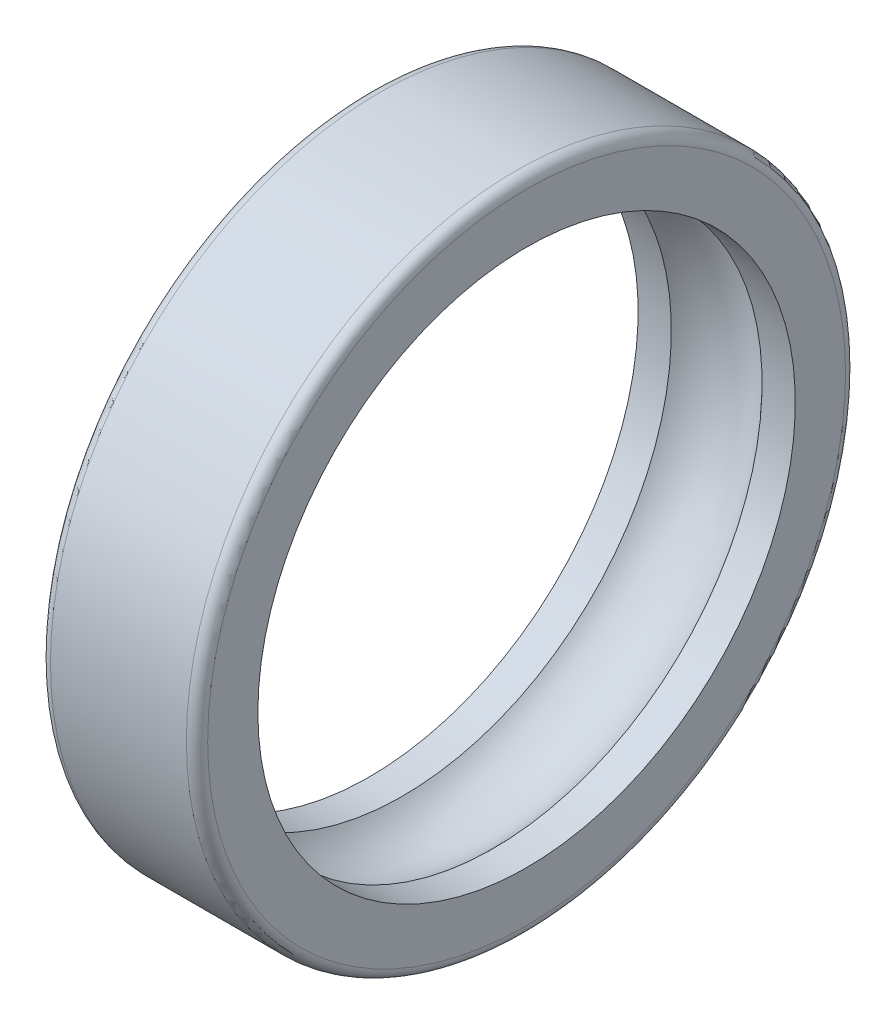
ISO-10303-21;
HEADER;
FILE_DESCRIPTION(('STEP AP214'),'2;1');
FILE_NAME('part.step','',(''),(''),'','','');
FILE_SCHEMA(('AUTOMOTIVE_DESIGN { 1 0 10303 214 1 1 1 1 }'));
ENDSEC;
DATA;
#1=APPLICATION_CONTEXT('core data for automotive mechanical design processes');
#2=APPLICATION_PROTOCOL_DEFINITION('international standard','automotive_design',2000,#1);
#3=PRODUCT_CONTEXT('',#1,'mechanical');
#4=PRODUCT('Part','Part','',(#3));
#5=PRODUCT_RELATED_PRODUCT_CATEGORY('part','',(#4));
#6=PRODUCT_DEFINITION_FORMATION('','',#4);
#7=PRODUCT_DEFINITION_CONTEXT('part definition',#1,'design');
#8=PRODUCT_DEFINITION('design','',#6,#7);
#9=PRODUCT_DEFINITION_SHAPE('','',#8);
#10=(LENGTH_UNIT() NAMED_UNIT(*) SI_UNIT(.MILLI.,.METRE.));
#11=(NAMED_UNIT(*) PLANE_ANGLE_UNIT() SI_UNIT($,.RADIAN.));
#12=(NAMED_UNIT(*) SI_UNIT($,.STERADIAN.) SOLID_ANGLE_UNIT());
#13=UNCERTAINTY_MEASURE_WITH_UNIT(LENGTH_MEASURE(1.E-05),#10,'distance_accuracy_value','');
#14=(GEOMETRIC_REPRESENTATION_CONTEXT(3) GLOBAL_UNCERTAINTY_ASSIGNED_CONTEXT((#13)) GLOBAL_UNIT_ASSIGNED_CONTEXT((#10,
#11,#12)) REPRESENTATION_CONTEXT('',''));
#15=CARTESIAN_POINT('',(0.,0.,0.));
#16=DIRECTION('',(0.,0.,1.));
#17=DIRECTION('',(1.,0.,0.));
#18=AXIS2_PLACEMENT_3D('',#15,#16,#17);
#19=CARTESIAN_POINT('',(15.660221907753,53.,0.));
#20=DIRECTION('',(-1.,0.,0.));
#21=DIRECTION('',(0.,0.,1.));
#22=AXIS2_PLACEMENT_3D('',#19,#20,#21);
#23=PLANE('',#22);
#24=CARTESIAN_POINT('',(15.660221907753,0.,0.));
#25=DIRECTION('',(-1.,0.,0.));
#26=DIRECTION('',(0.,0.,1.));
#27=AXIS2_PLACEMENT_3D('',#24,#25,#26);
#28=CIRCLE('',#27,62.9);
#29=CARTESIAN_POINT('',(15.660221907753,0.,62.9));
#30=VERTEX_POINT('',#29);
#31=EDGE_CURVE('E38',#30,#30,#28,.F.);
#32=ORIENTED_EDGE('',*,*,#31,.T.);
#33=EDGE_LOOP('',(#32));
#34=FACE_BOUND('',#33,.T.);
#35=CARTESIAN_POINT('',(15.660221907753,0.,0.));
#36=DIRECTION('',(-1.,0.,0.));
#37=DIRECTION('',(0.,0.,1.));
#38=AXIS2_PLACEMENT_3D('',#35,#36,#37);
#39=CIRCLE('',#38,53.);
#40=CARTESIAN_POINT('',(15.660221907753,0.,53.));
#41=VERTEX_POINT('',#40);
#42=EDGE_CURVE('E51',#41,#41,#39,.T.);
#43=ORIENTED_EDGE('',*,*,#42,.T.);
#44=EDGE_LOOP('',(#43));
#45=FACE_BOUND('',#44,.T.);
#46=ADVANCED_FACE('F31',(#34,#45),#23,.F.);
#47=CARTESIAN_POINT('',(-16.0399932094926,0.,0.));
#48=DIRECTION('',(-1.,0.,0.));
#49=DIRECTION('',(0.,0.,1.));
#50=AXIS2_PLACEMENT_3D('',#47,#48,#49);
#51=CYLINDRICAL_SURFACE('',#50,53.);
#52=ORIENTED_EDGE('',*,*,#42,.F.);
#53=EDGE_LOOP('',(#52));
#54=FACE_BOUND('',#53,.T.);
#55=CARTESIAN_POINT('',(9.10449381775213,0.,0.));
#56=DIRECTION('',(-1.,0.,0.));
#57=DIRECTION('',(0.,0.,1.));
#58=AXIS2_PLACEMENT_3D('',#55,#56,#57);
#59=CIRCLE('',#58,53.);
#60=CARTESIAN_POINT('',(9.10449381775213,0.,53.));
#61=VERTEX_POINT('',#60);
#62=EDGE_CURVE('E54',#61,#61,#59,.T.);
#63=ORIENTED_EDGE('',*,*,#62,.T.);
#64=EDGE_LOOP('',(#63));
#65=FACE_BOUND('',#64,.T.);
#66=ADVANCED_FACE('F81',(#54,#65),#51,.F.);
#67=CARTESIAN_POINT('',(0.160221907752977,0.,0.));
#68=DIRECTION('',(-1.,0.,0.));
#69=DIRECTION('',(0.,0.,1.));
#70=AXIS2_PLACEMENT_3D('',#67,#68,#69);
#71=TOROIDAL_SURFACE('',#70,45.,12.);
#72=ORIENTED_EDGE('',*,*,#62,.F.);
#73=EDGE_LOOP('',(#72));
#74=FACE_BOUND('',#73,.T.);
#75=CARTESIAN_POINT('',(-8.78405000224618,0.,0.));
#76=DIRECTION('',(-1.,0.,0.));
#77=DIRECTION('',(0.,0.,1.));
#78=AXIS2_PLACEMENT_3D('',#75,#76,#77);
#79=CIRCLE('',#78,53.);
#80=CARTESIAN_POINT('',(-8.78405000224618,0.,53.));
#81=VERTEX_POINT('',#80);
#82=EDGE_CURVE('E57',#81,#81,#79,.T.);
#83=ORIENTED_EDGE('',*,*,#82,.T.);
#84=EDGE_LOOP('',(#83));
#85=FACE_BOUND('',#84,.T.);
#86=ADVANCED_FACE('F77',(#74,#85),#71,.F.);
#87=CARTESIAN_POINT('',(-16.0399932094926,0.,0.));
#88=DIRECTION('',(-1.,0.,0.));
#89=DIRECTION('',(0.,0.,1.));
#90=AXIS2_PLACEMENT_3D('',#87,#88,#89);
#91=CYLINDRICAL_SURFACE('',#90,53.);
#92=ORIENTED_EDGE('',*,*,#82,.F.);
#93=EDGE_LOOP('',(#92));
#94=FACE_BOUND('',#93,.T.);
#95=CARTESIAN_POINT('',(-15.339778092247,0.,0.));
#96=DIRECTION('',(-1.,0.,0.));
#97=DIRECTION('',(0.,0.,1.));
#98=AXIS2_PLACEMENT_3D('',#95,#96,#97);
#99=CIRCLE('',#98,53.);
#100=CARTESIAN_POINT('',(-15.339778092247,0.,53.));
#101=VERTEX_POINT('',#100);
#102=EDGE_CURVE('E60',#101,#101,#99,.T.);
#103=ORIENTED_EDGE('',*,*,#102,.T.);
#104=EDGE_LOOP('',(#103));
#105=FACE_BOUND('',#104,.T.);
#106=ADVANCED_FACE('F64',(#94,#105),#91,.F.);
#107=CARTESIAN_POINT('',(-15.339778092247,53.,0.));
#108=DIRECTION('',(1.,0.,0.));
#109=DIRECTION('',(0.,0.,-1.));
#110=AXIS2_PLACEMENT_3D('',#107,#108,#109);
#111=PLANE('',#110);
#112=CARTESIAN_POINT('',(-15.339778092247,0.,0.));
#113=DIRECTION('',(1.,0.,0.));
#114=DIRECTION('',(0.,0.,-1.));
#115=AXIS2_PLACEMENT_3D('',#112,#113,#114);
#116=CIRCLE('',#115,62.9);
#117=CARTESIAN_POINT('',(-15.339778092247,0.,-62.9));
#118=VERTEX_POINT('',#117);
#119=EDGE_CURVE('E10',#118,#118,#116,.F.);
#120=ORIENTED_EDGE('',*,*,#119,.T.);
#121=EDGE_LOOP('',(#120));
#122=FACE_BOUND('',#121,.T.);
#123=ORIENTED_EDGE('',*,*,#102,.F.);
#124=EDGE_LOOP('',(#123));
#125=FACE_BOUND('',#124,.T.);
#126=ADVANCED_FACE('F66',(#122,#125),#111,.F.);
#127=CARTESIAN_POINT('',(-16.0399932094926,0.,0.));
#128=DIRECTION('',(-1.,0.,0.));
#129=DIRECTION('',(0.,0.,1.));
#130=AXIS2_PLACEMENT_3D('',#127,#128,#129);
#131=CYLINDRICAL_SURFACE('',#130,65.);
#132=CARTESIAN_POINT('',(13.560221907753,0.,0.));
#133=DIRECTION('',(-1.,0.,0.));
#134=DIRECTION('',(0.,0.,1.));
#135=AXIS2_PLACEMENT_3D('',#132,#133,#134);
#136=CIRCLE('',#135,65.);
#137=CARTESIAN_POINT('',(13.560221907753,0.,65.));
#138=VERTEX_POINT('',#137);
#139=EDGE_CURVE('E42',#138,#138,#136,.T.);
#140=ORIENTED_EDGE('',*,*,#139,.T.);
#141=EDGE_LOOP('',(#140));
#142=FACE_BOUND('',#141,.T.);
#143=CARTESIAN_POINT('',(-13.239778092247,0.,0.));
#144=DIRECTION('',(1.,0.,0.));
#145=DIRECTION('',(0.,0.,-1.));
#146=AXIS2_PLACEMENT_3D('',#143,#144,#145);
#147=CIRCLE('',#146,65.);
#148=CARTESIAN_POINT('',(-13.239778092247,0.,-65.));
#149=VERTEX_POINT('',#148);
#150=EDGE_CURVE('E46',#149,#149,#147,.T.);
#151=ORIENTED_EDGE('',*,*,#150,.T.);
#152=EDGE_LOOP('',(#151));
#153=FACE_BOUND('',#152,.T.);
#154=ADVANCED_FACE('F68',(#142,#153),#131,.T.);
#155=CARTESIAN_POINT('',(13.560221907753,0.,0.));
#156=DIRECTION('',(-1.,0.,0.));
#157=DIRECTION('',(0.,0.,1.));
#158=AXIS2_PLACEMENT_3D('',#155,#156,#157);
#159=TOROIDAL_SURFACE('',#158,62.9,2.1);
#160=ORIENTED_EDGE('',*,*,#31,.F.);
#161=EDGE_LOOP('',(#160));
#162=FACE_BOUND('',#161,.T.);
#163=ORIENTED_EDGE('',*,*,#139,.F.);
#164=EDGE_LOOP('',(#163));
#165=FACE_BOUND('',#164,.T.);
#166=ADVANCED_FACE('F74',(#162,#165),#159,.T.);
#167=CARTESIAN_POINT('',(-13.239778092247,0.,0.));
#168=DIRECTION('',(1.,0.,0.));
#169=DIRECTION('',(0.,0.,-1.));
#170=AXIS2_PLACEMENT_3D('',#167,#168,#169);
#171=TOROIDAL_SURFACE('',#170,62.9,2.1);
#172=ORIENTED_EDGE('',*,*,#150,.F.);
#173=EDGE_LOOP('',(#172));
#174=FACE_BOUND('',#173,.T.);
#175=ORIENTED_EDGE('',*,*,#119,.F.);
#176=EDGE_LOOP('',(#175));
#177=FACE_BOUND('',#176,.T.);
#178=ADVANCED_FACE('F33',(#174,#177),#171,.T.);
#179=CLOSED_SHELL('',(#46,#66,#86,#106,#126,#154,#166,#178));
#180=MANIFOLD_SOLID_BREP('B2',#179);
#181=ADVANCED_BREP_SHAPE_REPRESENTATION('',(#18,#180),#14);
#182=SHAPE_DEFINITION_REPRESENTATION(#9,#181);
ENDSEC;
END-ISO-10303-21;
